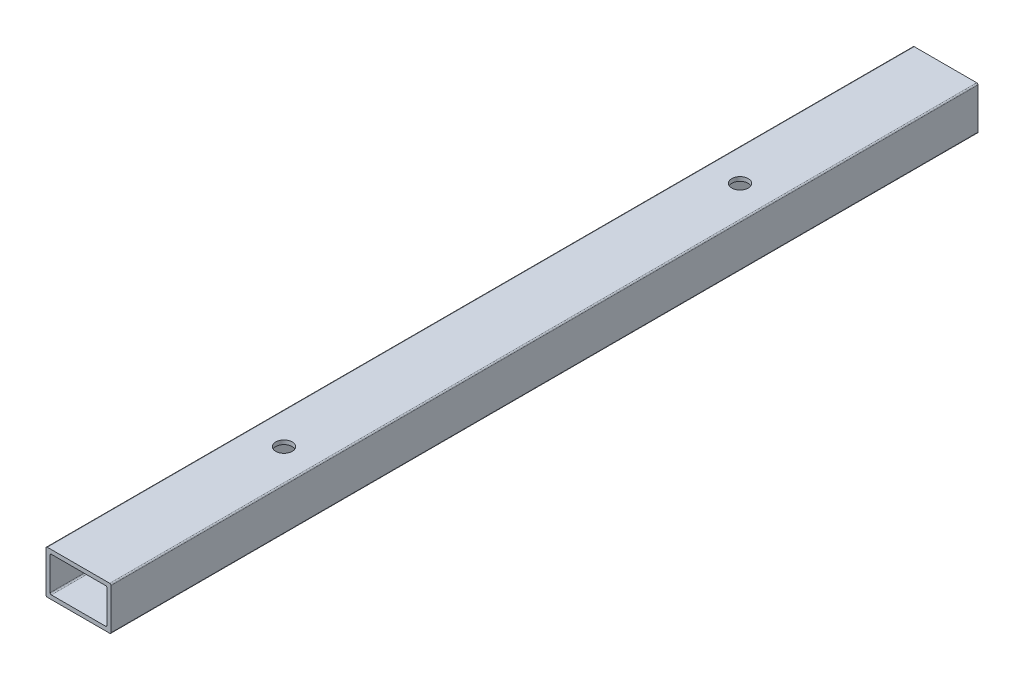
ISO-10303-21;
HEADER;
FILE_DESCRIPTION(('STEP AP214'),'2;1');
FILE_NAME('part.step','',(''),(''),'','','');
FILE_SCHEMA(('AUTOMOTIVE_DESIGN { 1 0 10303 214 1 1 1 1 }'));
ENDSEC;
DATA;
#1=APPLICATION_CONTEXT('core data for automotive mechanical design processes');
#2=APPLICATION_PROTOCOL_DEFINITION('international standard','automotive_design',2000,#1);
#3=PRODUCT_CONTEXT('',#1,'mechanical');
#4=PRODUCT('Part','Part','',(#3));
#5=PRODUCT_RELATED_PRODUCT_CATEGORY('part','',(#4));
#6=PRODUCT_DEFINITION_FORMATION('','',#4);
#7=PRODUCT_DEFINITION_CONTEXT('part definition',#1,'design');
#8=PRODUCT_DEFINITION('design','',#6,#7);
#9=PRODUCT_DEFINITION_SHAPE('','',#8);
#10=(LENGTH_UNIT() NAMED_UNIT(*) SI_UNIT(.MILLI.,.METRE.));
#11=(NAMED_UNIT(*) PLANE_ANGLE_UNIT() SI_UNIT($,.RADIAN.));
#12=(NAMED_UNIT(*) SI_UNIT($,.STERADIAN.) SOLID_ANGLE_UNIT());
#13=UNCERTAINTY_MEASURE_WITH_UNIT(LENGTH_MEASURE(1.E-05),#10,'distance_accuracy_value','');
#14=(GEOMETRIC_REPRESENTATION_CONTEXT(3) GLOBAL_UNCERTAINTY_ASSIGNED_CONTEXT((#13)) GLOBAL_UNIT_ASSIGNED_CONTEXT((#10,
#11,#12)) REPRESENTATION_CONTEXT('',''));
#15=CARTESIAN_POINT('',(0.,0.,0.));
#16=DIRECTION('',(0.,0.,1.));
#17=DIRECTION('',(1.,0.,0.));
#18=AXIS2_PLACEMENT_3D('',#15,#16,#17);
#19=CARTESIAN_POINT('',(-9.14400000000002,5.96899999999999,254.));
#20=DIRECTION('',(0.,0.,-1.));
#21=DIRECTION('',(-1.,0.,0.));
#22=AXIS2_PLACEMENT_3D('',#19,#20,#21);
#23=CYLINDRICAL_SURFACE('',#22,0.380999999999999);
#24=CARTESIAN_POINT('',(-9.14400000000002,5.96899999999999,254.));
#25=DIRECTION('',(0.,0.,-1.));
#26=DIRECTION('',(-1.,0.,0.));
#27=AXIS2_PLACEMENT_3D('',#24,#25,#26);
#28=CIRCLE('',#27,0.380999999999999);
#29=CARTESIAN_POINT('',(-9.52500000000002,5.96899999999999,254.));
#30=VERTEX_POINT('',#29);
#31=CARTESIAN_POINT('',(-9.14400000000002,6.34999999999999,254.));
#32=VERTEX_POINT('',#31);
#33=EDGE_CURVE('E134',#30,#32,#28,.T.);
#34=ORIENTED_EDGE('',*,*,#33,.T.);
#35=DIRECTION('',(0.,0.,-1.));
#36=VECTOR('',#35,1.);
#37=CARTESIAN_POINT('',(-9.14400000000002,6.34999999999999,254.));
#38=LINE('',#37,#36);
#39=CARTESIAN_POINT('',(-9.14400000000002,6.34999999999999,0.));
#40=VERTEX_POINT('',#39);
#41=EDGE_CURVE('E132',#32,#40,#38,.T.);
#42=ORIENTED_EDGE('',*,*,#41,.T.);
#43=CARTESIAN_POINT('',(-9.14400000000002,5.96899999999999,0.));
#44=DIRECTION('',(0.,0.,-1.));
#45=DIRECTION('',(-1.,0.,0.));
#46=AXIS2_PLACEMENT_3D('',#43,#44,#45);
#47=CIRCLE('',#46,0.380999999999999);
#48=CARTESIAN_POINT('',(-9.52500000000002,5.96899999999999,0.));
#49=VERTEX_POINT('',#48);
#50=EDGE_CURVE('E19',#40,#49,#47,.F.);
#51=ORIENTED_EDGE('',*,*,#50,.T.);
#52=DIRECTION('',(0.,0.,-1.));
#53=VECTOR('',#52,1.);
#54=CARTESIAN_POINT('',(-9.52500000000002,5.96899999999999,254.));
#55=LINE('',#54,#53);
#56=EDGE_CURVE('E129',#49,#30,#55,.F.);
#57=ORIENTED_EDGE('',*,*,#56,.T.);
#58=EDGE_LOOP('',(#34,#42,#51,#57));
#59=FACE_BOUND('',#58,.T.);
#60=ADVANCED_FACE('F16',(#59),#23,.T.);
#61=CARTESIAN_POINT('',(9.14399999999998,5.96899999999999,254.));
#62=DIRECTION('',(0.,0.,-1.));
#63=DIRECTION('',(-1.,0.,0.));
#64=AXIS2_PLACEMENT_3D('',#61,#62,#63);
#65=CYLINDRICAL_SURFACE('',#64,0.380999999999999);
#66=CARTESIAN_POINT('',(9.14399999999998,5.96899999999999,254.));
#67=DIRECTION('',(0.,0.,-1.));
#68=DIRECTION('',(-1.,0.,0.));
#69=AXIS2_PLACEMENT_3D('',#66,#67,#68);
#70=CIRCLE('',#69,0.380999999999999);
#71=CARTESIAN_POINT('',(9.14399999999998,6.34999999999999,254.));
#72=VERTEX_POINT('',#71);
#73=CARTESIAN_POINT('',(9.52499999999998,5.96899999999999,254.));
#74=VERTEX_POINT('',#73);
#75=EDGE_CURVE('E263',#72,#74,#70,.T.);
#76=ORIENTED_EDGE('',*,*,#75,.T.);
#77=DIRECTION('',(0.,0.,1.));
#78=VECTOR('',#77,1.);
#79=CARTESIAN_POINT('',(9.52499999999998,5.96899999999999,254.));
#80=LINE('',#79,#78);
#81=CARTESIAN_POINT('',(9.52499999999998,5.96899999999999,0.));
#82=VERTEX_POINT('',#81);
#83=EDGE_CURVE('E212',#74,#82,#80,.F.);
#84=ORIENTED_EDGE('',*,*,#83,.T.);
#85=CARTESIAN_POINT('',(9.14399999999998,5.96899999999999,0.));
#86=DIRECTION('',(0.,0.,-1.));
#87=DIRECTION('',(-1.,0.,0.));
#88=AXIS2_PLACEMENT_3D('',#85,#86,#87);
#89=CIRCLE('',#88,0.380999999999999);
#90=CARTESIAN_POINT('',(9.14399999999998,6.34999999999999,0.));
#91=VERTEX_POINT('',#90);
#92=EDGE_CURVE('E265',#82,#91,#89,.F.);
#93=ORIENTED_EDGE('',*,*,#92,.T.);
#94=DIRECTION('',(0.,0.,-1.));
#95=VECTOR('',#94,1.);
#96=CARTESIAN_POINT('',(9.14399999999998,6.34999999999999,254.));
#97=LINE('',#96,#95);
#98=EDGE_CURVE('E219',#91,#72,#97,.F.);
#99=ORIENTED_EDGE('',*,*,#98,.T.);
#100=EDGE_LOOP('',(#76,#84,#93,#99));
#101=FACE_BOUND('',#100,.T.);
#102=ADVANCED_FACE('F277',(#101),#65,.T.);
#103=CARTESIAN_POINT('',(-7.95020000000002,-4.7752,254.));
#104=DIRECTION('',(0.,0.,-1.));
#105=DIRECTION('',(-1.,0.,0.));
#106=AXIS2_PLACEMENT_3D('',#103,#104,#105);
#107=CYLINDRICAL_SURFACE('',#106,0.380999999999999);
#108=DIRECTION('',(0.,0.,-1.));
#109=VECTOR('',#108,1.);
#110=CARTESIAN_POINT('',(-8.33120000000002,-4.7752,254.));
#111=LINE('',#110,#109);
#112=CARTESIAN_POINT('',(-8.33120000000002,-4.7752,254.));
#113=VERTEX_POINT('',#112);
#114=CARTESIAN_POINT('',(-8.33120000000002,-4.7752,0.));
#115=VERTEX_POINT('',#114);
#116=EDGE_CURVE('E206',#113,#115,#111,.T.);
#117=ORIENTED_EDGE('',*,*,#116,.F.);
#118=CARTESIAN_POINT('',(-7.95020000000002,-4.7752,254.));
#119=DIRECTION('',(0.,0.,-1.));
#120=DIRECTION('',(-1.,0.,0.));
#121=AXIS2_PLACEMENT_3D('',#118,#119,#120);
#122=CIRCLE('',#121,0.380999999999999);
#123=CARTESIAN_POINT('',(-7.95020000000002,-5.1562,254.));
#124=VERTEX_POINT('',#123);
#125=EDGE_CURVE('E261',#124,#113,#122,.T.);
#126=ORIENTED_EDGE('',*,*,#125,.F.);
#127=DIRECTION('',(0.,0.,1.));
#128=VECTOR('',#127,1.);
#129=CARTESIAN_POINT('',(-7.95020000000002,-5.1562,254.));
#130=LINE('',#129,#128);
#131=CARTESIAN_POINT('',(-7.95020000000002,-5.1562,0.));
#132=VERTEX_POINT('',#131);
#133=EDGE_CURVE('E203',#132,#124,#130,.T.);
#134=ORIENTED_EDGE('',*,*,#133,.F.);
#135=CARTESIAN_POINT('',(-7.95020000000002,-4.7752,0.));
#136=DIRECTION('',(0.,0.,-1.));
#137=DIRECTION('',(-1.,0.,0.));
#138=AXIS2_PLACEMENT_3D('',#135,#136,#137);
#139=CIRCLE('',#138,0.380999999999999);
#140=EDGE_CURVE('E259',#115,#132,#139,.F.);
#141=ORIENTED_EDGE('',*,*,#140,.F.);
#142=EDGE_LOOP('',(#117,#126,#134,#141));
#143=FACE_BOUND('',#142,.T.);
#144=ADVANCED_FACE('F311',(#143),#107,.F.);
#145=CARTESIAN_POINT('',(7.95019999999998,-4.7752,254.));
#146=DIRECTION('',(0.,0.,-1.));
#147=DIRECTION('',(-1.,0.,0.));
#148=AXIS2_PLACEMENT_3D('',#145,#146,#147);
#149=CYLINDRICAL_SURFACE('',#148,0.380999999999999);
#150=DIRECTION('',(0.,0.,1.));
#151=VECTOR('',#150,1.);
#152=CARTESIAN_POINT('',(7.95019999999997,-5.1562,254.));
#153=LINE('',#152,#151);
#154=CARTESIAN_POINT('',(7.95019999999997,-5.1562,254.));
#155=VERTEX_POINT('',#154);
#156=CARTESIAN_POINT('',(7.95019999999997,-5.1562,0.));
#157=VERTEX_POINT('',#156);
#158=EDGE_CURVE('E199',#155,#157,#153,.F.);
#159=ORIENTED_EDGE('',*,*,#158,.F.);
#160=CARTESIAN_POINT('',(7.95019999999998,-4.7752,254.));
#161=DIRECTION('',(0.,0.,-1.));
#162=DIRECTION('',(-1.,0.,0.));
#163=AXIS2_PLACEMENT_3D('',#160,#161,#162);
#164=CIRCLE('',#163,0.380999999999999);
#165=CARTESIAN_POINT('',(8.33119999999998,-4.7752,254.));
#166=VERTEX_POINT('',#165);
#167=EDGE_CURVE('E257',#166,#155,#164,.T.);
#168=ORIENTED_EDGE('',*,*,#167,.F.);
#169=DIRECTION('',(0.,0.,1.));
#170=VECTOR('',#169,1.);
#171=CARTESIAN_POINT('',(8.33119999999998,-4.7752,254.));
#172=LINE('',#171,#170);
#173=CARTESIAN_POINT('',(8.33119999999998,-4.7752,0.));
#174=VERTEX_POINT('',#173);
#175=EDGE_CURVE('E195',#174,#166,#172,.T.);
#176=ORIENTED_EDGE('',*,*,#175,.F.);
#177=CARTESIAN_POINT('',(7.95019999999998,-4.7752,0.));
#178=DIRECTION('',(0.,0.,-1.));
#179=DIRECTION('',(-1.,0.,0.));
#180=AXIS2_PLACEMENT_3D('',#177,#178,#179);
#181=CIRCLE('',#180,0.380999999999999);
#182=EDGE_CURVE('E255',#157,#174,#181,.F.);
#183=ORIENTED_EDGE('',*,*,#182,.F.);
#184=EDGE_LOOP('',(#159,#168,#176,#183));
#185=FACE_BOUND('',#184,.T.);
#186=ADVANCED_FACE('F318',(#185),#149,.F.);
#187=CARTESIAN_POINT('',(0.,-6.35000000000001,193.802));
#188=DIRECTION('',(0.,1.,0.));
#189=DIRECTION('',(0.,0.,1.));
#190=AXIS2_PLACEMENT_3D('',#187,#188,#189);
#191=CYLINDRICAL_SURFACE('',#190,2.413);
#192=CARTESIAN_POINT('',(0.,5.1562,193.802));
#193=DIRECTION('',(0.,1.,0.));
#194=DIRECTION('',(0.,0.,1.));
#195=AXIS2_PLACEMENT_3D('',#192,#193,#194);
#196=CIRCLE('',#195,2.413);
#197=CARTESIAN_POINT('',(0.,5.1562,196.215));
#198=VERTEX_POINT('',#197);
#199=EDGE_CURVE('E202',#198,#198,#196,.T.);
#200=ORIENTED_EDGE('',*,*,#199,.F.);
#201=EDGE_LOOP('',(#200));
#202=FACE_BOUND('',#201,.T.);
#203=CARTESIAN_POINT('',(0.,6.34999999999999,193.802));
#204=DIRECTION('',(0.,1.,0.));
#205=DIRECTION('',(0.,0.,1.));
#206=AXIS2_PLACEMENT_3D('',#203,#204,#205);
#207=CIRCLE('',#206,2.413);
#208=CARTESIAN_POINT('',(0.,6.34999999999999,196.215));
#209=VERTEX_POINT('',#208);
#210=EDGE_CURVE('E141',#209,#209,#207,.T.);
#211=ORIENTED_EDGE('',*,*,#210,.T.);
#212=EDGE_LOOP('',(#211));
#213=FACE_BOUND('',#212,.T.);
#214=ADVANCED_FACE('F386',(#202,#213),#191,.F.);
#215=CARTESIAN_POINT('',(0.,-6.35000000000001,60.198));
#216=DIRECTION('',(0.,1.,0.));
#217=DIRECTION('',(0.,0.,1.));
#218=AXIS2_PLACEMENT_3D('',#215,#216,#217);
#219=CYLINDRICAL_SURFACE('',#218,2.413);
#220=CARTESIAN_POINT('',(0.,5.1562,60.198));
#221=DIRECTION('',(0.,1.,0.));
#222=DIRECTION('',(0.,0.,1.));
#223=AXIS2_PLACEMENT_3D('',#220,#221,#222);
#224=CIRCLE('',#223,2.413);
#225=CARTESIAN_POINT('',(0.,5.1562,62.611));
#226=VERTEX_POINT('',#225);
#227=EDGE_CURVE('E191',#226,#226,#224,.T.);
#228=ORIENTED_EDGE('',*,*,#227,.F.);
#229=EDGE_LOOP('',(#228));
#230=FACE_BOUND('',#229,.T.);
#231=CARTESIAN_POINT('',(0.,6.34999999999999,60.198));
#232=DIRECTION('',(0.,1.,0.));
#233=DIRECTION('',(0.,0.,1.));
#234=AXIS2_PLACEMENT_3D('',#231,#232,#233);
#235=CIRCLE('',#234,2.413);
#236=CARTESIAN_POINT('',(0.,6.34999999999999,62.611));
#237=VERTEX_POINT('',#236);
#238=EDGE_CURVE('E221',#237,#237,#235,.T.);
#239=ORIENTED_EDGE('',*,*,#238,.T.);
#240=EDGE_LOOP('',(#239));
#241=FACE_BOUND('',#240,.T.);
#242=ADVANCED_FACE('F383',(#230,#241),#219,.F.);
#243=CARTESIAN_POINT('',(7.95019999999998,4.77519999999999,254.));
#244=DIRECTION('',(0.,0.,-1.));
#245=DIRECTION('',(-1.,0.,0.));
#246=AXIS2_PLACEMENT_3D('',#243,#244,#245);
#247=CYLINDRICAL_SURFACE('',#246,0.380999999999999);
#248=DIRECTION('',(0.,0.,1.));
#249=VECTOR('',#248,1.);
#250=CARTESIAN_POINT('',(8.33119999999998,4.77519999999999,254.));
#251=LINE('',#250,#249);
#252=CARTESIAN_POINT('',(8.33119999999998,4.77519999999999,254.));
#253=VERTEX_POINT('',#252);
#254=CARTESIAN_POINT('',(8.33119999999998,4.77519999999999,0.));
#255=VERTEX_POINT('',#254);
#256=EDGE_CURVE('E198',#253,#255,#251,.F.);
#257=ORIENTED_EDGE('',*,*,#256,.F.);
#258=CARTESIAN_POINT('',(7.95019999999998,4.77519999999999,254.));
#259=DIRECTION('',(0.,0.,-1.));
#260=DIRECTION('',(-1.,0.,0.));
#261=AXIS2_PLACEMENT_3D('',#258,#259,#260);
#262=CIRCLE('',#261,0.380999999999999);
#263=CARTESIAN_POINT('',(7.95019999999998,5.15619999999999,254.));
#264=VERTEX_POINT('',#263);
#265=EDGE_CURVE('E253',#264,#253,#262,.T.);
#266=ORIENTED_EDGE('',*,*,#265,.F.);
#267=DIRECTION('',(0.,0.,-1.));
#268=VECTOR('',#267,1.);
#269=CARTESIAN_POINT('',(7.95019999999997,5.15619999999999,254.));
#270=LINE('',#269,#268);
#271=CARTESIAN_POINT('',(7.95019999999998,5.15619999999999,0.));
#272=VERTEX_POINT('',#271);
#273=EDGE_CURVE('E187',#272,#264,#270,.F.);
#274=ORIENTED_EDGE('',*,*,#273,.F.);
#275=CARTESIAN_POINT('',(7.95019999999998,4.77519999999999,0.));
#276=DIRECTION('',(0.,0.,-1.));
#277=DIRECTION('',(-1.,0.,0.));
#278=AXIS2_PLACEMENT_3D('',#275,#276,#277);
#279=CIRCLE('',#278,0.380999999999999);
#280=EDGE_CURVE('E251',#255,#272,#279,.F.);
#281=ORIENTED_EDGE('',*,*,#280,.F.);
#282=EDGE_LOOP('',(#257,#266,#274,#281));
#283=FACE_BOUND('',#282,.T.);
#284=ADVANCED_FACE('F326',(#283),#247,.F.);
#285=CARTESIAN_POINT('',(-7.95020000000002,4.77519999999999,254.));
#286=DIRECTION('',(0.,0.,-1.));
#287=DIRECTION('',(-1.,0.,0.));
#288=AXIS2_PLACEMENT_3D('',#285,#286,#287);
#289=CYLINDRICAL_SURFACE('',#288,0.380999999999999);
#290=DIRECTION('',(0.,0.,-1.));
#291=VECTOR('',#290,1.);
#292=CARTESIAN_POINT('',(-7.95020000000002,5.15619999999999,254.));
#293=LINE('',#292,#291);
#294=CARTESIAN_POINT('',(-7.95020000000002,5.15619999999999,254.));
#295=VERTEX_POINT('',#294);
#296=CARTESIAN_POINT('',(-7.95020000000002,5.15619999999999,0.));
#297=VERTEX_POINT('',#296);
#298=EDGE_CURVE('E190',#295,#297,#293,.T.);
#299=ORIENTED_EDGE('',*,*,#298,.F.);
#300=CARTESIAN_POINT('',(-7.95020000000002,4.77519999999999,254.));
#301=DIRECTION('',(0.,0.,-1.));
#302=DIRECTION('',(-1.,0.,0.));
#303=AXIS2_PLACEMENT_3D('',#300,#301,#302);
#304=CIRCLE('',#303,0.380999999999999);
#305=CARTESIAN_POINT('',(-8.33120000000002,4.77519999999999,254.));
#306=VERTEX_POINT('',#305);
#307=EDGE_CURVE('E249',#306,#295,#304,.T.);
#308=ORIENTED_EDGE('',*,*,#307,.F.);
#309=DIRECTION('',(0.,0.,-1.));
#310=VECTOR('',#309,1.);
#311=CARTESIAN_POINT('',(-8.33120000000002,4.77519999999999,254.));
#312=LINE('',#311,#310);
#313=CARTESIAN_POINT('',(-8.33120000000002,4.77519999999999,0.));
#314=VERTEX_POINT('',#313);
#315=EDGE_CURVE('E209',#314,#306,#312,.F.);
#316=ORIENTED_EDGE('',*,*,#315,.F.);
#317=CARTESIAN_POINT('',(-7.95020000000002,4.77519999999999,0.));
#318=DIRECTION('',(0.,0.,-1.));
#319=DIRECTION('',(-1.,0.,0.));
#320=AXIS2_PLACEMENT_3D('',#317,#318,#319);
#321=CIRCLE('',#320,0.380999999999999);
#322=EDGE_CURVE('E142',#297,#314,#321,.F.);
#323=ORIENTED_EDGE('',*,*,#322,.F.);
#324=EDGE_LOOP('',(#299,#308,#316,#323));
#325=FACE_BOUND('',#324,.T.);
#326=ADVANCED_FACE('F302',(#325),#289,.F.);
#327=CARTESIAN_POINT('',(-9.52500000000002,-5.969,254.));
#328=DIRECTION('',(1.,0.,0.));
#329=DIRECTION('',(0.,0.,-1.));
#330=AXIS2_PLACEMENT_3D('',#327,#328,#329);
#331=PLANE('',#330);
#332=DIRECTION('',(0.,0.,-1.));
#333=VECTOR('',#332,1.);
#334=CARTESIAN_POINT('',(-9.52500000000002,-5.969,254.));
#335=LINE('',#334,#333);
#336=CARTESIAN_POINT('',(-9.52500000000002,-5.969,254.));
#337=VERTEX_POINT('',#336);
#338=CARTESIAN_POINT('',(-9.52500000000002,-5.969,0.));
#339=VERTEX_POINT('',#338);
#340=EDGE_CURVE('E186',#337,#339,#335,.T.);
#341=ORIENTED_EDGE('',*,*,#340,.F.);
#342=DIRECTION('',(0.,1.,0.));
#343=VECTOR('',#342,1.);
#344=CARTESIAN_POINT('',(-9.52500000000002,-5.969,254.));
#345=LINE('',#344,#343);
#346=EDGE_CURVE('E140',#337,#30,#345,.T.);
#347=ORIENTED_EDGE('',*,*,#346,.T.);
#348=ORIENTED_EDGE('',*,*,#56,.F.);
#349=DIRECTION('',(0.,1.,0.));
#350=VECTOR('',#349,1.);
#351=CARTESIAN_POINT('',(-9.52500000000002,-5.969,0.));
#352=LINE('',#351,#350);
#353=EDGE_CURVE('E139',#339,#49,#352,.T.);
#354=ORIENTED_EDGE('',*,*,#353,.F.);
#355=EDGE_LOOP('',(#341,#347,#348,#354));
#356=FACE_BOUND('',#355,.T.);
#357=ADVANCED_FACE('F138',(#356),#331,.F.);
#358=CARTESIAN_POINT('',(-9.14400000000002,6.34999999999999,254.));
#359=DIRECTION('',(0.,-1.,0.));
#360=DIRECTION('',(0.,0.,-1.));
#361=AXIS2_PLACEMENT_3D('',#358,#359,#360);
#362=PLANE('',#361);
#363=ORIENTED_EDGE('',*,*,#41,.F.);
#364=DIRECTION('',(-1.,0.,0.));
#365=VECTOR('',#364,1.);
#366=CARTESIAN_POINT('',(-9.14400000000002,6.35,254.));
#367=LINE('',#366,#365);
#368=EDGE_CURVE('E182',#32,#72,#367,.F.);
#369=ORIENTED_EDGE('',*,*,#368,.T.);
#370=ORIENTED_EDGE('',*,*,#98,.F.);
#371=DIRECTION('',(-1.,0.,0.));
#372=VECTOR('',#371,1.);
#373=CARTESIAN_POINT('',(-9.14400000000002,6.35,0.));
#374=LINE('',#373,#372);
#375=EDGE_CURVE('E148',#40,#91,#374,.F.);
#376=ORIENTED_EDGE('',*,*,#375,.F.);
#377=EDGE_LOOP('',(#363,#369,#370,#376));
#378=FACE_BOUND('',#377,.T.);
#379=ORIENTED_EDGE('',*,*,#238,.F.);
#380=EDGE_LOOP('',(#379));
#381=FACE_BOUND('',#380,.T.);
#382=ORIENTED_EDGE('',*,*,#210,.F.);
#383=EDGE_LOOP('',(#382));
#384=FACE_BOUND('',#383,.T.);
#385=ADVANCED_FACE('F269',(#378,#381,#384),#362,.F.);
#386=CARTESIAN_POINT('',(9.52499999999998,-5.969,254.));
#387=DIRECTION('',(-1.,0.,0.));
#388=DIRECTION('',(0.,0.,1.));
#389=AXIS2_PLACEMENT_3D('',#386,#387,#388);
#390=PLANE('',#389);
#391=ORIENTED_EDGE('',*,*,#83,.F.);
#392=DIRECTION('',(0.,1.,0.));
#393=VECTOR('',#392,1.);
#394=CARTESIAN_POINT('',(9.52499999999998,-5.969,254.));
#395=LINE('',#394,#393);
#396=CARTESIAN_POINT('',(9.52499999999998,-5.969,254.));
#397=VERTEX_POINT('',#396);
#398=EDGE_CURVE('E179',#74,#397,#395,.F.);
#399=ORIENTED_EDGE('',*,*,#398,.T.);
#400=DIRECTION('',(0.,0.,-1.));
#401=VECTOR('',#400,1.);
#402=CARTESIAN_POINT('',(9.52499999999998,-5.969,254.));
#403=LINE('',#402,#401);
#404=CARTESIAN_POINT('',(9.52499999999998,-5.969,0.));
#405=VERTEX_POINT('',#404);
#406=EDGE_CURVE('E168',#405,#397,#403,.F.);
#407=ORIENTED_EDGE('',*,*,#406,.F.);
#408=DIRECTION('',(0.,1.,0.));
#409=VECTOR('',#408,1.);
#410=CARTESIAN_POINT('',(9.52499999999998,-5.969,0.));
#411=LINE('',#410,#409);
#412=EDGE_CURVE('E150',#82,#405,#411,.F.);
#413=ORIENTED_EDGE('',*,*,#412,.F.);
#414=EDGE_LOOP('',(#391,#399,#407,#413));
#415=FACE_BOUND('',#414,.T.);
#416=ADVANCED_FACE('F281',(#415),#390,.F.);
#417=CARTESIAN_POINT('',(-8.33120000000002,-4.7752,254.));
#418=DIRECTION('',(1.,0.,0.));
#419=DIRECTION('',(0.,0.,-1.));
#420=AXIS2_PLACEMENT_3D('',#417,#418,#419);
#421=PLANE('',#420);
#422=DIRECTION('',(0.,1.,0.));
#423=VECTOR('',#422,1.);
#424=CARTESIAN_POINT('',(-8.33120000000002,-5.969,254.));
#425=LINE('',#424,#423);
#426=EDGE_CURVE('E165',#306,#113,#425,.F.);
#427=ORIENTED_EDGE('',*,*,#426,.T.);
#428=ORIENTED_EDGE('',*,*,#116,.T.);
#429=DIRECTION('',(0.,1.,0.));
#430=VECTOR('',#429,1.);
#431=CARTESIAN_POINT('',(-8.33120000000002,-5.969,0.));
#432=LINE('',#431,#430);
#433=EDGE_CURVE('E231',#314,#115,#432,.F.);
#434=ORIENTED_EDGE('',*,*,#433,.F.);
#435=ORIENTED_EDGE('',*,*,#315,.T.);
#436=EDGE_LOOP('',(#427,#428,#434,#435));
#437=FACE_BOUND('',#436,.T.);
#438=ADVANCED_FACE('F306',(#437),#421,.T.);
#439=CARTESIAN_POINT('',(-7.95020000000002,-5.1562,254.));
#440=DIRECTION('',(0.,1.,0.));
#441=DIRECTION('',(0.,0.,1.));
#442=AXIS2_PLACEMENT_3D('',#439,#440,#441);
#443=PLANE('',#442);
#444=DIRECTION('',(-1.,0.,0.));
#445=VECTOR('',#444,1.);
#446=CARTESIAN_POINT('',(-9.14400000000002,-5.1562,254.));
#447=LINE('',#446,#445);
#448=EDGE_CURVE('E175',#124,#155,#447,.F.);
#449=ORIENTED_EDGE('',*,*,#448,.T.);
#450=ORIENTED_EDGE('',*,*,#158,.T.);
#451=DIRECTION('',(-1.,0.,0.));
#452=VECTOR('',#451,1.);
#453=CARTESIAN_POINT('',(-9.14400000000002,-5.1562,0.));
#454=LINE('',#453,#452);
#455=EDGE_CURVE('E285',#132,#157,#454,.F.);
#456=ORIENTED_EDGE('',*,*,#455,.F.);
#457=ORIENTED_EDGE('',*,*,#133,.T.);
#458=EDGE_LOOP('',(#449,#450,#456,#457));
#459=FACE_BOUND('',#458,.T.);
#460=CARTESIAN_POINT('',(0.,-5.1562,60.198));
#461=DIRECTION('',(0.,1.,0.));
#462=DIRECTION('',(0.,0.,1.));
#463=AXIS2_PLACEMENT_3D('',#460,#461,#462);
#464=CIRCLE('',#463,2.413);
#465=CARTESIAN_POINT('',(0.,-5.1562,62.611));
#466=VERTEX_POINT('',#465);
#467=EDGE_CURVE('E224',#466,#466,#464,.F.);
#468=ORIENTED_EDGE('',*,*,#467,.T.);
#469=EDGE_LOOP('',(#468));
#470=FACE_BOUND('',#469,.T.);
#471=CARTESIAN_POINT('',(0.,-5.1562,193.802));
#472=DIRECTION('',(0.,1.,0.));
#473=DIRECTION('',(0.,0.,1.));
#474=AXIS2_PLACEMENT_3D('',#471,#472,#473);
#475=CIRCLE('',#474,2.413);
#476=CARTESIAN_POINT('',(0.,-5.1562,196.215));
#477=VERTEX_POINT('',#476);
#478=EDGE_CURVE('E194',#477,#477,#475,.F.);
#479=ORIENTED_EDGE('',*,*,#478,.T.);
#480=EDGE_LOOP('',(#479));
#481=FACE_BOUND('',#480,.T.);
#482=ADVANCED_FACE('F314',(#459,#470,#481),#443,.T.);
#483=CARTESIAN_POINT('',(8.33119999999998,-4.7752,254.));
#484=DIRECTION('',(-1.,0.,0.));
#485=DIRECTION('',(0.,-1.,0.));
#486=AXIS2_PLACEMENT_3D('',#483,#484,#485);
#487=PLANE('',#486);
#488=DIRECTION('',(0.,1.,0.));
#489=VECTOR('',#488,1.);
#490=CARTESIAN_POINT('',(8.33119999999998,-5.969,254.));
#491=LINE('',#490,#489);
#492=EDGE_CURVE('E172',#166,#253,#491,.T.);
#493=ORIENTED_EDGE('',*,*,#492,.T.);
#494=ORIENTED_EDGE('',*,*,#256,.T.);
#495=DIRECTION('',(0.,1.,0.));
#496=VECTOR('',#495,1.);
#497=CARTESIAN_POINT('',(8.33119999999998,-5.969,0.));
#498=LINE('',#497,#496);
#499=EDGE_CURVE('E288',#174,#255,#498,.T.);
#500=ORIENTED_EDGE('',*,*,#499,.F.);
#501=ORIENTED_EDGE('',*,*,#175,.T.);
#502=EDGE_LOOP('',(#493,#494,#500,#501));
#503=FACE_BOUND('',#502,.T.);
#504=ADVANCED_FACE('F322',(#503),#487,.T.);
#505=CARTESIAN_POINT('',(-7.95020000000002,5.15619999999999,254.));
#506=DIRECTION('',(0.,-1.,0.));
#507=DIRECTION('',(0.,0.,-1.));
#508=AXIS2_PLACEMENT_3D('',#505,#506,#507);
#509=PLANE('',#508);
#510=DIRECTION('',(-1.,0.,0.));
#511=VECTOR('',#510,1.);
#512=CARTESIAN_POINT('',(-9.14400000000002,5.15619999999999,254.));
#513=LINE('',#512,#511);
#514=EDGE_CURVE('E169',#264,#295,#513,.T.);
#515=ORIENTED_EDGE('',*,*,#514,.T.);
#516=ORIENTED_EDGE('',*,*,#298,.T.);
#517=DIRECTION('',(-1.,0.,0.));
#518=VECTOR('',#517,1.);
#519=CARTESIAN_POINT('',(-9.14400000000002,5.15619999999999,0.));
#520=LINE('',#519,#518);
#521=EDGE_CURVE('E230',#272,#297,#520,.T.);
#522=ORIENTED_EDGE('',*,*,#521,.F.);
#523=ORIENTED_EDGE('',*,*,#273,.T.);
#524=EDGE_LOOP('',(#515,#516,#522,#523));
#525=FACE_BOUND('',#524,.T.);
#526=ORIENTED_EDGE('',*,*,#227,.T.);
#527=EDGE_LOOP('',(#526));
#528=FACE_BOUND('',#527,.T.);
#529=ORIENTED_EDGE('',*,*,#199,.T.);
#530=EDGE_LOOP('',(#529));
#531=FACE_BOUND('',#530,.T.);
#532=ADVANCED_FACE('F297',(#525,#528,#531),#509,.T.);
#533=CARTESIAN_POINT('',(0.,-6.35000000000001,193.802));
#534=DIRECTION('',(0.,1.,0.));
#535=DIRECTION('',(0.,0.,1.));
#536=AXIS2_PLACEMENT_3D('',#533,#534,#535);
#537=CYLINDRICAL_SURFACE('',#536,2.413);
#538=CARTESIAN_POINT('',(0.,-6.35000000000001,193.802));
#539=DIRECTION('',(0.,1.,0.));
#540=DIRECTION('',(0.,0.,1.));
#541=AXIS2_PLACEMENT_3D('',#538,#539,#540);
#542=CIRCLE('',#541,2.413);
#543=CARTESIAN_POINT('',(0.,-6.35000000000001,196.215));
#544=VERTEX_POINT('',#543);
#545=EDGE_CURVE('E227',#544,#544,#542,.F.);
#546=ORIENTED_EDGE('',*,*,#545,.T.);
#547=EDGE_LOOP('',(#546));
#548=FACE_BOUND('',#547,.T.);
#549=ORIENTED_EDGE('',*,*,#478,.F.);
#550=EDGE_LOOP('',(#549));
#551=FACE_BOUND('',#550,.T.);
#552=ADVANCED_FACE('F357',(#548,#551),#537,.F.);
#553=CARTESIAN_POINT('',(0.,-6.35000000000001,60.198));
#554=DIRECTION('',(0.,1.,0.));
#555=DIRECTION('',(0.,0.,1.));
#556=AXIS2_PLACEMENT_3D('',#553,#554,#555);
#557=CYLINDRICAL_SURFACE('',#556,2.413);
#558=CARTESIAN_POINT('',(0.,-6.35000000000001,60.198));
#559=DIRECTION('',(0.,1.,0.));
#560=DIRECTION('',(0.,0.,1.));
#561=AXIS2_PLACEMENT_3D('',#558,#559,#560);
#562=CIRCLE('',#561,2.413);
#563=CARTESIAN_POINT('',(0.,-6.35000000000001,62.611));
#564=VERTEX_POINT('',#563);
#565=EDGE_CURVE('E162',#564,#564,#562,.F.);
#566=ORIENTED_EDGE('',*,*,#565,.T.);
#567=EDGE_LOOP('',(#566));
#568=FACE_BOUND('',#567,.T.);
#569=ORIENTED_EDGE('',*,*,#467,.F.);
#570=EDGE_LOOP('',(#569));
#571=FACE_BOUND('',#570,.T.);
#572=ADVANCED_FACE('F339',(#568,#571),#557,.F.);
#573=CARTESIAN_POINT('',(-9.14400000000002,-5.969,254.));
#574=DIRECTION('',(0.,0.,-1.));
#575=DIRECTION('',(-1.,0.,0.));
#576=AXIS2_PLACEMENT_3D('',#573,#574,#575);
#577=CYLINDRICAL_SURFACE('',#576,0.380999999999999);
#578=CARTESIAN_POINT('',(-9.14400000000002,-5.969,254.));
#579=DIRECTION('',(0.,0.,-1.));
#580=DIRECTION('',(-1.,0.,0.));
#581=AXIS2_PLACEMENT_3D('',#578,#579,#580);
#582=CIRCLE('',#581,0.380999999999999);
#583=CARTESIAN_POINT('',(-9.14400000000002,-6.35000000000001,254.));
#584=VERTEX_POINT('',#583);
#585=EDGE_CURVE('E178',#584,#337,#582,.T.);
#586=ORIENTED_EDGE('',*,*,#585,.T.);
#587=ORIENTED_EDGE('',*,*,#340,.T.);
#588=CARTESIAN_POINT('',(-9.14400000000002,-5.969,0.));
#589=DIRECTION('',(0.,0.,-1.));
#590=DIRECTION('',(-1.,0.,0.));
#591=AXIS2_PLACEMENT_3D('',#588,#589,#590);
#592=CIRCLE('',#591,0.380999999999999);
#593=CARTESIAN_POINT('',(-9.14400000000002,-6.35000000000001,0.));
#594=VERTEX_POINT('',#593);
#595=EDGE_CURVE('E147',#594,#339,#592,.T.);
#596=ORIENTED_EDGE('',*,*,#595,.F.);
#597=DIRECTION('',(0.,0.,1.));
#598=VECTOR('',#597,1.);
#599=CARTESIAN_POINT('',(-9.14400000000002,-6.35000000000001,254.));
#600=LINE('',#599,#598);
#601=EDGE_CURVE('E159',#594,#584,#600,.T.);
#602=ORIENTED_EDGE('',*,*,#601,.T.);
#603=EDGE_LOOP('',(#586,#587,#596,#602));
#604=FACE_BOUND('',#603,.T.);
#605=ADVANCED_FACE('F330',(#604),#577,.T.);
#606=CARTESIAN_POINT('',(-9.14400000000002,-5.969,254.));
#607=DIRECTION('',(0.,0.,-1.));
#608=DIRECTION('',(-1.,0.,0.));
#609=AXIS2_PLACEMENT_3D('',#606,#607,#608);
#610=PLANE('',#609);
#611=ORIENTED_EDGE('',*,*,#426,.F.);
#612=ORIENTED_EDGE('',*,*,#307,.T.);
#613=ORIENTED_EDGE('',*,*,#514,.F.);
#614=ORIENTED_EDGE('',*,*,#265,.T.);
#615=ORIENTED_EDGE('',*,*,#492,.F.);
#616=ORIENTED_EDGE('',*,*,#167,.T.);
#617=ORIENTED_EDGE('',*,*,#448,.F.);
#618=ORIENTED_EDGE('',*,*,#125,.T.);
#619=EDGE_LOOP('',(#611,#612,#613,#614,#615,#616,#617,#618));
#620=FACE_BOUND('',#619,.T.);
#621=DIRECTION('',(1.,0.,0.));
#622=VECTOR('',#621,1.);
#623=CARTESIAN_POINT('',(-9.14400000000002,-6.35000000000001,254.));
#624=LINE('',#623,#622);
#625=CARTESIAN_POINT('',(9.14399999999998,-6.35000000000001,254.));
#626=VERTEX_POINT('',#625);
#627=EDGE_CURVE('E157',#584,#626,#624,.T.);
#628=ORIENTED_EDGE('',*,*,#627,.T.);
#629=CARTESIAN_POINT('',(9.14399999999998,-5.969,254.));
#630=DIRECTION('',(0.,0.,-1.));
#631=DIRECTION('',(-1.,0.,0.));
#632=AXIS2_PLACEMENT_3D('',#629,#630,#631);
#633=CIRCLE('',#632,0.380999999999999);
#634=EDGE_CURVE('E152',#397,#626,#633,.T.);
#635=ORIENTED_EDGE('',*,*,#634,.F.);
#636=ORIENTED_EDGE('',*,*,#398,.F.);
#637=ORIENTED_EDGE('',*,*,#75,.F.);
#638=ORIENTED_EDGE('',*,*,#368,.F.);
#639=ORIENTED_EDGE('',*,*,#33,.F.);
#640=ORIENTED_EDGE('',*,*,#346,.F.);
#641=ORIENTED_EDGE('',*,*,#585,.F.);
#642=EDGE_LOOP('',(#628,#635,#636,#637,#638,#639,#640,#641));
#643=FACE_BOUND('',#642,.T.);
#644=ADVANCED_FACE('F272',(#620,#643),#610,.F.);
#645=CARTESIAN_POINT('',(9.14399999999998,-5.969,254.));
#646=DIRECTION('',(0.,0.,-1.));
#647=DIRECTION('',(-1.,0.,0.));
#648=AXIS2_PLACEMENT_3D('',#645,#646,#647);
#649=CYLINDRICAL_SURFACE('',#648,0.380999999999999);
#650=ORIENTED_EDGE('',*,*,#634,.T.);
#651=DIRECTION('',(0.,0.,1.));
#652=VECTOR('',#651,1.);
#653=CARTESIAN_POINT('',(9.14399999999998,-6.35000000000001,254.));
#654=LINE('',#653,#652);
#655=CARTESIAN_POINT('',(9.14399999999998,-6.35000000000001,0.));
#656=VERTEX_POINT('',#655);
#657=EDGE_CURVE('E25',#626,#656,#654,.F.);
#658=ORIENTED_EDGE('',*,*,#657,.T.);
#659=CARTESIAN_POINT('',(9.14399999999998,-5.969,0.));
#660=DIRECTION('',(0.,0.,-1.));
#661=DIRECTION('',(-1.,0.,0.));
#662=AXIS2_PLACEMENT_3D('',#659,#660,#661);
#663=CIRCLE('',#662,0.380999999999999);
#664=EDGE_CURVE('E33',#405,#656,#663,.T.);
#665=ORIENTED_EDGE('',*,*,#664,.F.);
#666=ORIENTED_EDGE('',*,*,#406,.T.);
#667=EDGE_LOOP('',(#650,#658,#665,#666));
#668=FACE_BOUND('',#667,.T.);
#669=ADVANCED_FACE('F329',(#668),#649,.T.);
#670=CARTESIAN_POINT('',(-9.14400000000002,-5.969,0.));
#671=DIRECTION('',(0.,0.,-1.));
#672=DIRECTION('',(-1.,0.,0.));
#673=AXIS2_PLACEMENT_3D('',#670,#671,#672);
#674=PLANE('',#673);
#675=ORIENTED_EDGE('',*,*,#521,.T.);
#676=ORIENTED_EDGE('',*,*,#322,.T.);
#677=ORIENTED_EDGE('',*,*,#433,.T.);
#678=ORIENTED_EDGE('',*,*,#140,.T.);
#679=ORIENTED_EDGE('',*,*,#455,.T.);
#680=ORIENTED_EDGE('',*,*,#182,.T.);
#681=ORIENTED_EDGE('',*,*,#499,.T.);
#682=ORIENTED_EDGE('',*,*,#280,.T.);
#683=EDGE_LOOP('',(#675,#676,#677,#678,#679,#680,#681,#682));
#684=FACE_BOUND('',#683,.T.);
#685=ORIENTED_EDGE('',*,*,#664,.T.);
#686=DIRECTION('',(1.,0.,0.));
#687=VECTOR('',#686,1.);
#688=CARTESIAN_POINT('',(-9.14400000000002,-6.35000000000001,0.));
#689=LINE('',#688,#687);
#690=EDGE_CURVE('E11',#656,#594,#689,.F.);
#691=ORIENTED_EDGE('',*,*,#690,.T.);
#692=ORIENTED_EDGE('',*,*,#595,.T.);
#693=ORIENTED_EDGE('',*,*,#353,.T.);
#694=ORIENTED_EDGE('',*,*,#50,.F.);
#695=ORIENTED_EDGE('',*,*,#375,.T.);
#696=ORIENTED_EDGE('',*,*,#92,.F.);
#697=ORIENTED_EDGE('',*,*,#412,.T.);
#698=EDGE_LOOP('',(#685,#691,#692,#693,#694,#695,#696,#697));
#699=FACE_BOUND('',#698,.T.);
#700=ADVANCED_FACE('F145',(#684,#699),#674,.T.);
#701=CARTESIAN_POINT('',(-9.14400000000002,-6.35000000000001,254.));
#702=DIRECTION('',(0.,1.,0.));
#703=DIRECTION('',(0.,0.,1.));
#704=AXIS2_PLACEMENT_3D('',#701,#702,#703);
#705=PLANE('',#704);
#706=ORIENTED_EDGE('',*,*,#657,.F.);
#707=ORIENTED_EDGE('',*,*,#627,.F.);
#708=ORIENTED_EDGE('',*,*,#601,.F.);
#709=ORIENTED_EDGE('',*,*,#690,.F.);
#710=EDGE_LOOP('',(#706,#707,#708,#709));
#711=FACE_BOUND('',#710,.T.);
#712=ORIENTED_EDGE('',*,*,#565,.F.);
#713=EDGE_LOOP('',(#712));
#714=FACE_BOUND('',#713,.T.);
#715=ORIENTED_EDGE('',*,*,#545,.F.);
#716=EDGE_LOOP('',(#715));
#717=FACE_BOUND('',#716,.T.);
#718=ADVANCED_FACE('F342',(#711,#714,#717),#705,.F.);
#719=CLOSED_SHELL('',(#60,#102,#144,#186,#214,#242,#284,#326,#357,#385,#416,#438,#482,#504,#532,
#552,#572,#605,#644,#669,#700,#718));
#720=MANIFOLD_SOLID_BREP('B1',#719);
#721=ADVANCED_BREP_SHAPE_REPRESENTATION('',(#18,#720),#14);
#722=SHAPE_DEFINITION_REPRESENTATION(#9,#721);
ENDSEC;
END-ISO-10303-21;
